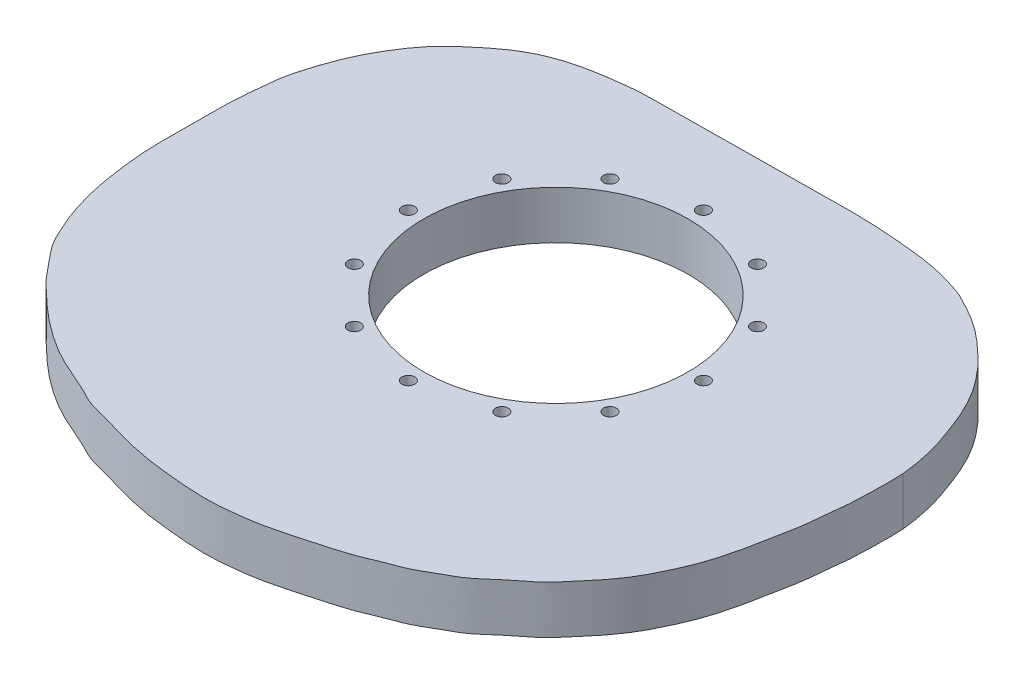
ISO-10303-21;
HEADER;
FILE_DESCRIPTION(('STEP AP214'),'2;1');
FILE_NAME('part.step','',(''),(''),'','','');
FILE_SCHEMA(('AUTOMOTIVE_DESIGN { 1 0 10303 214 1 1 1 1 }'));
ENDSEC;
DATA;
#1=APPLICATION_CONTEXT('core data for automotive mechanical design processes');
#2=APPLICATION_PROTOCOL_DEFINITION('international standard','automotive_design',2000,#1);
#3=PRODUCT_CONTEXT('',#1,'mechanical');
#4=PRODUCT('Part','Part','',(#3));
#5=PRODUCT_RELATED_PRODUCT_CATEGORY('part','',(#4));
#6=PRODUCT_DEFINITION_FORMATION('','',#4);
#7=PRODUCT_DEFINITION_CONTEXT('part definition',#1,'design');
#8=PRODUCT_DEFINITION('design','',#6,#7);
#9=PRODUCT_DEFINITION_SHAPE('','',#8);
#10=(LENGTH_UNIT() NAMED_UNIT(*) SI_UNIT(.MILLI.,.METRE.));
#11=(NAMED_UNIT(*) PLANE_ANGLE_UNIT() SI_UNIT($,.RADIAN.));
#12=(NAMED_UNIT(*) SI_UNIT($,.STERADIAN.) SOLID_ANGLE_UNIT());
#13=UNCERTAINTY_MEASURE_WITH_UNIT(LENGTH_MEASURE(1.E-05),#10,'distance_accuracy_value','');
#14=(GEOMETRIC_REPRESENTATION_CONTEXT(3) GLOBAL_UNCERTAINTY_ASSIGNED_CONTEXT((#13)) GLOBAL_UNIT_ASSIGNED_CONTEXT((#10,
#11,#12)) REPRESENTATION_CONTEXT('',''));
#15=CARTESIAN_POINT('',(0.,0.,0.));
#16=DIRECTION('',(0.,0.,1.));
#17=DIRECTION('',(1.,0.,0.));
#18=AXIS2_PLACEMENT_3D('',#15,#16,#17);
#19=CARTESIAN_POINT('',(-380.049242401864,20.4,11.3845061236139));
#20=CARTESIAN_POINT('',(-379.780162952301,20.4,14.7307854673375));
#21=CARTESIAN_POINT('',(-379.846191862376,20.4,20.9013137044004));
#22=CARTESIAN_POINT('',(-379.978179165826,20.4,32.5081895156437));
#23=CARTESIAN_POINT('',(-380.478735134233,20.4,42.1285726277063));
#24=CARTESIAN_POINT('',(-381.935896415638,20.4,51.4349297154578));
#25=CARTESIAN_POINT('',(-382.239451767936,20.4,58.9167819072398));
#26=CARTESIAN_POINT('',(-383.498849059042,20.4,66.2150618601163));
#27=CARTESIAN_POINT('',(-385.100288245759,20.4,73.5704882095732));
#28=CARTESIAN_POINT('',(-386.854241829526,20.4,84.1235568244484));
#29=CARTESIAN_POINT('',(-388.923669000459,20.4,93.1236220798791));
#30=CARTESIAN_POINT('',(-392.042287791231,20.4,104.805455108899));
#31=CARTESIAN_POINT('',(-397.621768074888,20.4,117.696417735138));
#32=CARTESIAN_POINT('',(-403.000646081092,20.4,128.490795573473));
#33=CARTESIAN_POINT('',(-410.493980899893,20.4,139.328454670797));
#34=CARTESIAN_POINT('',(-418.752029855762,20.4,148.53916230787));
#35=CARTESIAN_POINT('',(-425.254220573375,20.4,156.659460430327));
#36=CARTESIAN_POINT('',(-434.141792993513,20.4,162.772660135546));
#37=CARTESIAN_POINT('',(-442.200673858222,20.4,170.296384681626));
#38=CARTESIAN_POINT('',(-449.285579072647,20.4,175.925612235357));
#39=CARTESIAN_POINT('',(-457.127275413485,20.4,179.763339121568));
#40=CARTESIAN_POINT('',(-466.622184699591,20.4,185.76578685844));
#41=CARTESIAN_POINT('',(-475.470893594921,20.4,188.514516298542));
#42=CARTESIAN_POINT('',(-485.928212709025,20.4,193.471241405311));
#43=CARTESIAN_POINT('',(-500.806129360535,20.4,197.778091630592));
#44=CARTESIAN_POINT('',(-512.58593978717,20.4,201.034632879465));
#45=CARTESIAN_POINT('',(-527.522968625672,20.4,204.922987531498));
#46=CARTESIAN_POINT('',(-539.56970131468,20.4,206.291002112992));
#47=CARTESIAN_POINT('',(-549.976053816279,20.4,207.4281754248));
#48=CARTESIAN_POINT('',(-564.40483180107,20.4,206.832438516235));
#49=CARTESIAN_POINT('',(-575.418430160224,20.4,205.662168010058));
#50=CARTESIAN_POINT('',(-587.878160610122,20.4,204.273850610462));
#51=CARTESIAN_POINT('',(-603.130207722923,20.4,200.783493104247));
#52=CARTESIAN_POINT('',(-612.113684776168,20.4,197.577423722934));
#53=CARTESIAN_POINT('',(-627.718557893987,20.4,194.173130242001));
#54=CARTESIAN_POINT('',(-634.095803665696,20.4,189.897384062605));
#55=CARTESIAN_POINT('',(-651.593849459066,20.4,182.911582900073));
#56=CARTESIAN_POINT('',(-664.382461732481,20.4,175.574467603105));
#57=CARTESIAN_POINT('',(-678.206935923738,20.4,165.478516530878));
#58=CARTESIAN_POINT('',(-687.223081888725,20.4,156.809984362792));
#59=CARTESIAN_POINT('',(-695.525171461678,20.4,149.350196139007));
#60=CARTESIAN_POINT('',(-702.170293731733,20.4,140.542517459404));
#61=CARTESIAN_POINT('',(-709.617350154339,20.4,132.16055239735));
#62=CARTESIAN_POINT('',(-712.082084167832,20.4,127.12503620513));
#63=CARTESIAN_POINT('',(-713.402971141437,20.4,124.355557991248));
#64=B_SPLINE_CURVE_WITH_KNOTS('',3,(#19,#20,#21,#22,#23,#24,#25,#26,#27,#28,#29,#30,#31,#32,#33,
#34,#35,#36,#37,#38,#39,#40,#41,#42,#43,#44,#45,#46,#47,#48,#49,#50,#51,#52,#53,#54,#55,#56,#57,
#58,#59,#60,#61,#62,#63),.UNSPECIFIED.,.F.,.F.,(4,1,1,1,1,1,1,1,1,1,1,1,1,1,1,1,1,1,1,1,1,1,1,1,
1,1,1,1,1,1,1,1,1,1,1,1,1,1,1,1,1,1,4),(0.,0.011057524887745,0.023106803849047,
0.034286565656152,0.045146462907837,0.054906303386894,0.0644612144718484,0.074300184895033,
0.085873006198691,0.0967627123337795,0.109109722933161,0.122485741039739,0.134903237923388,
0.147801700599383,0.160352453572541,0.17177215607166,0.183437491534666,0.195295584152877,
0.20591990748763,0.216455958918776,0.228313211160655,0.239119491013559,0.251227774329023,
0.265193689356207,0.277840174826075,0.291770934589318,0.304140322960004,0.315687360851266,
0.329134843609005,0.341030624064557,0.353715367786723,0.367624517934225,0.379042033809947,
0.392834845349619,0.403004910596959,0.418108184860972,0.432230009470601,0.44682282099098,
0.459474552421583,0.471251080776367,0.483145943696471,0.49495788707002,0.505448590100979),.UNSPECIFIED.);
#65=DIRECTION('',(0.,-1.,0.));
#66=VECTOR('',#65,1.);
#67=SURFACE_OF_LINEAR_EXTRUSION('',#64,#66);
#68=CARTESIAN_POINT('',(-380.049242401864,-5.,11.3845061236139));
#69=CARTESIAN_POINT('',(-379.780162952301,-5.,14.7307854673375));
#70=CARTESIAN_POINT('',(-379.846191862376,-5.,20.9013137044004));
#71=CARTESIAN_POINT('',(-379.978179165826,-5.,32.5081895156437));
#72=CARTESIAN_POINT('',(-380.478735134233,-5.,42.1285726277063));
#73=CARTESIAN_POINT('',(-381.935896415638,-5.,51.4349297154578));
#74=CARTESIAN_POINT('',(-382.239451767936,-5.,58.9167819072398));
#75=CARTESIAN_POINT('',(-383.498849059042,-5.,66.2150618601163));
#76=CARTESIAN_POINT('',(-385.100288245759,-5.,73.5704882095732));
#77=CARTESIAN_POINT('',(-386.854241829526,-5.,84.1235568244484));
#78=CARTESIAN_POINT('',(-388.923669000459,-5.,93.1236220798791));
#79=CARTESIAN_POINT('',(-392.042287791231,-5.,104.805455108899));
#80=CARTESIAN_POINT('',(-397.621768074888,-5.,117.696417735138));
#81=CARTESIAN_POINT('',(-403.000646081092,-5.,128.490795573473));
#82=CARTESIAN_POINT('',(-410.493980899893,-5.,139.328454670797));
#83=CARTESIAN_POINT('',(-418.752029855762,-5.,148.53916230787));
#84=CARTESIAN_POINT('',(-425.254220573375,-5.,156.659460430327));
#85=CARTESIAN_POINT('',(-434.141792993513,-5.,162.772660135546));
#86=CARTESIAN_POINT('',(-442.200673858222,-5.,170.296384681626));
#87=CARTESIAN_POINT('',(-449.285579072647,-5.,175.925612235357));
#88=CARTESIAN_POINT('',(-457.127275413485,-5.,179.763339121568));
#89=CARTESIAN_POINT('',(-466.622184699591,-5.,185.76578685844));
#90=CARTESIAN_POINT('',(-475.470893594921,-5.,188.514516298542));
#91=CARTESIAN_POINT('',(-485.928212709025,-5.,193.471241405311));
#92=CARTESIAN_POINT('',(-500.806129360535,-5.,197.778091630592));
#93=CARTESIAN_POINT('',(-512.58593978717,-5.,201.034632879465));
#94=CARTESIAN_POINT('',(-527.522968625672,-5.,204.922987531498));
#95=CARTESIAN_POINT('',(-539.56970131468,-5.,206.291002112992));
#96=CARTESIAN_POINT('',(-549.976053816279,-5.,207.4281754248));
#97=CARTESIAN_POINT('',(-564.40483180107,-5.,206.832438516235));
#98=CARTESIAN_POINT('',(-575.418430160224,-5.,205.662168010058));
#99=CARTESIAN_POINT('',(-587.878160610122,-5.,204.273850610462));
#100=CARTESIAN_POINT('',(-603.130207722923,-5.,200.783493104247));
#101=CARTESIAN_POINT('',(-612.113684776168,-5.,197.577423722934));
#102=CARTESIAN_POINT('',(-627.718557893987,-5.,194.173130242001));
#103=CARTESIAN_POINT('',(-634.095803665696,-5.,189.897384062605));
#104=CARTESIAN_POINT('',(-651.593849459066,-5.,182.911582900073));
#105=CARTESIAN_POINT('',(-664.382461732481,-5.,175.574467603105));
#106=CARTESIAN_POINT('',(-678.206935923738,-5.,165.478516530878));
#107=CARTESIAN_POINT('',(-687.223081888725,-5.,156.809984362792));
#108=CARTESIAN_POINT('',(-695.525171461678,-5.,149.350196139007));
#109=CARTESIAN_POINT('',(-702.170293731733,-5.,140.542517459404));
#110=CARTESIAN_POINT('',(-709.617350154339,-5.,132.16055239735));
#111=CARTESIAN_POINT('',(-712.082084167832,-5.,127.12503620513));
#112=CARTESIAN_POINT('',(-713.402971141437,-5.,124.355557991248));
#113=B_SPLINE_CURVE_WITH_KNOTS('',3,(#68,#69,#70,#71,#72,#73,#74,#75,#76,#77,#78,#79,#80,#81,
#82,#83,#84,#85,#86,#87,#88,#89,#90,#91,#92,#93,#94,#95,#96,#97,#98,#99,#100,#101,#102,#103,
#104,#105,#106,#107,#108,#109,#110,#111,#112),.UNSPECIFIED.,.F.,.F.,(4,1,1,1,1,1,1,1,1,1,1,1,1,
1,1,1,1,1,1,1,1,1,1,1,1,1,1,1,1,1,1,1,1,1,1,1,1,1,1,1,1,1,4),(0.,0.011057524887745,
0.023106803849047,0.034286565656152,0.045146462907837,0.054906303386894,0.0644612144718484,
0.074300184895033,0.085873006198691,0.0967627123337795,0.109109722933161,0.122485741039739,
0.134903237923388,0.147801700599383,0.160352453572541,0.17177215607166,0.183437491534666,
0.195295584152877,0.20591990748763,0.216455958918776,0.228313211160655,0.239119491013559,
0.251227774329023,0.265193689356207,0.277840174826075,0.291770934589318,0.304140322960004,
0.315687360851266,0.329134843609005,0.341030624064557,0.353715367786723,0.367624517934225,
0.379042033809947,0.392834845349619,0.403004910596959,0.418108184860972,0.432230009470601,
0.44682282099098,0.459474552421583,0.471251080776367,0.483145943696471,0.49495788707002,
0.505448590100979),.UNSPECIFIED.);
#114=CARTESIAN_POINT('',(-380.049242401864,-5.,11.3845061236139));
#115=VERTEX_POINT('',#114);
#116=CARTESIAN_POINT('',(-713.402971141437,-5.,124.355557991248));
#117=VERTEX_POINT('',#116);
#118=EDGE_CURVE('E69',#115,#117,#113,.T.);
#119=ORIENTED_EDGE('',*,*,#118,.F.);
#120=DIRECTION('',(0.,-1.,0.));
#121=VECTOR('',#120,1.);
#122=CARTESIAN_POINT('',(-380.049242401864,20.4,11.3845061236139));
#123=LINE('',#122,#121);
#124=CARTESIAN_POINT('',(-380.049242401864,20.4,11.3845061236139));
#125=VERTEX_POINT('',#124);
#126=EDGE_CURVE('E12',#125,#115,#123,.T.);
#127=ORIENTED_EDGE('',*,*,#126,.F.);
#128=CARTESIAN_POINT('',(-713.402971141437,20.4,124.355557991248));
#129=VERTEX_POINT('',#128);
#130=EDGE_CURVE('E74',#125,#129,#64,.T.);
#131=ORIENTED_EDGE('',*,*,#130,.T.);
#132=DIRECTION('',(0.,-1.,0.));
#133=VECTOR('',#132,1.);
#134=CARTESIAN_POINT('',(-713.402971141437,20.4,124.355557991248));
#135=LINE('',#134,#133);
#136=EDGE_CURVE('E43',#129,#117,#135,.T.);
#137=ORIENTED_EDGE('',*,*,#136,.T.);
#138=EDGE_LOOP('',(#119,#127,#131,#137));
#139=FACE_BOUND('',#138,.T.);
#140=ADVANCED_FACE('F39',(#139),#67,.T.);
#141=CARTESIAN_POINT('',(-713.402971141437,20.4,124.355557991248));
#142=CARTESIAN_POINT('',(-715.032505399705,20.4,120.93894497497));
#143=CARTESIAN_POINT('',(-719.307424347361,20.4,111.760000030505));
#144=CARTESIAN_POINT('',(-725.016148134605,20.4,91.652991887535));
#145=CARTESIAN_POINT('',(-728.210491830365,20.4,66.1658020612224));
#146=CARTESIAN_POINT('',(-728.183208156327,20.4,51.3784886443944));
#147=CARTESIAN_POINT('',(-728.01663630402,20.4,29.6220053179665));
#148=CARTESIAN_POINT('',(-728.061402676971,20.4,15.9523562047483));
#149=CARTESIAN_POINT('',(-726.432591043446,20.4,2.7477317531935));
#150=CARTESIAN_POINT('',(-725.870843695293,20.4,-5.46969876906918));
#151=CARTESIAN_POINT('',(-722.916833642013,20.4,-16.9364821217873));
#152=CARTESIAN_POINT('',(-717.454447416855,20.4,-32.8608975986239));
#153=CARTESIAN_POINT('',(-709.719423575941,20.4,-47.1790170003629));
#154=CARTESIAN_POINT('',(-700.818947164339,20.4,-59.8463921428996));
#155=CARTESIAN_POINT('',(-689.821764123809,20.4,-69.7892767016252));
#156=CARTESIAN_POINT('',(-677.544901799604,20.4,-79.679626512829));
#157=CARTESIAN_POINT('',(-665.55368629642,20.4,-85.8204330644414));
#158=CARTESIAN_POINT('',(-654.698440304467,20.4,-89.3135814280866));
#159=CARTESIAN_POINT('',(-643.969557150908,20.4,-91.505035168801));
#160=CARTESIAN_POINT('',(-632.616728818553,20.4,-93.1086678886019));
#161=CARTESIAN_POINT('',(-625.289819640032,20.4,-93.7426919495092));
#162=CARTESIAN_POINT('',(-620.863987687855,20.4,-94.0648784864602));
#163=CARTESIAN_POINT('',(-537.935613255589,20.4,-94.809968529902));
#164=CARTESIAN_POINT('',(-505.293765442361,20.4,-95.3604930139211));
#165=CARTESIAN_POINT('',(-483.883064645458,20.4,-93.5312414168362));
#166=CARTESIAN_POINT('',(-468.639960146114,20.4,-91.8901143002058));
#167=CARTESIAN_POINT('',(-459.378159259451,20.4,-89.3832489365909));
#168=CARTESIAN_POINT('',(-448.736085977697,20.4,-86.4745650055509));
#169=CARTESIAN_POINT('',(-441.765278826208,20.4,-82.6629916687302));
#170=CARTESIAN_POINT('',(-428.702675028092,20.4,-75.7200109672443));
#171=CARTESIAN_POINT('',(-416.38233597977,20.4,-64.7214781758247));
#172=CARTESIAN_POINT('',(-407.128882868165,20.4,-55.6519871847597));
#173=CARTESIAN_POINT('',(-398.29548692294,20.4,-43.9246514640519));
#174=CARTESIAN_POINT('',(-391.925650274417,20.4,-31.5757661273162));
#175=CARTESIAN_POINT('',(-388.103085236488,20.4,-21.3921433015355));
#176=CARTESIAN_POINT('',(-384.446209251173,20.4,-11.6637144844807));
#177=CARTESIAN_POINT('',(-381.694235544708,20.4,-0.755231417811822));
#178=CARTESIAN_POINT('',(-380.351727708708,20.4,7.62279063135813));
#179=CARTESIAN_POINT('',(-380.049242401864,20.4,11.3845061236139));
#180=B_SPLINE_CURVE_WITH_KNOTS('',3,(#141,#142,#143,#144,#145,#146,#147,#148,#149,#150,#151,
#152,#153,#154,#155,#156,#157,#158,#159,#160,#161,#162,#163,#164,#165,#166,#167,#168,#169,#170,
#171,#172,#173,#174,#175,#176,#177,#178,#179),.UNSPECIFIED.,.F.,.F.,(4,1,1,1,1,1,1,1,1,1,1,1,1,
1,1,1,1,1,1,1,1,1,1,1,1,1,1,1,1,1,1,1,1,1,1,1,4),(0.505448590100979,0.518390620966505,
0.534950073811097,0.552889158867884,0.566882267481526,0.583252797248444,0.596756178736409,
0.609472823143886,0.619643502656757,0.631728613966489,0.646428157970305,0.66089072906802,
0.67480354584206,0.688528394408729,0.702682112902502,0.715735824368265,0.727661195185593,
0.73951894674173,0.751751993278463,0.760828962957055,0.768286629864552,0.800164488858021,
0.822177689618744,0.838023986753107,0.851782326608868,0.862890244862564,0.874452438481538,
0.884527501278101,0.898120883899216,0.912697608456468,0.925545199984826,0.93914414341808,
0.952448677109738,0.964159562931538,0.975547388223282,0.987569698042618,1.),.UNSPECIFIED.);
#181=DIRECTION('',(0.,-1.,0.));
#182=VECTOR('',#181,1.);
#183=SURFACE_OF_LINEAR_EXTRUSION('',#180,#182);
#184=CARTESIAN_POINT('',(-713.402971141437,-5.,124.355557991248));
#185=CARTESIAN_POINT('',(-715.032505399705,-5.,120.93894497497));
#186=CARTESIAN_POINT('',(-719.307424347361,-5.,111.760000030505));
#187=CARTESIAN_POINT('',(-725.016148134605,-5.,91.652991887535));
#188=CARTESIAN_POINT('',(-728.210491830365,-5.,66.1658020612224));
#189=CARTESIAN_POINT('',(-728.183208156327,-5.,51.3784886443944));
#190=CARTESIAN_POINT('',(-728.01663630402,-5.,29.6220053179665));
#191=CARTESIAN_POINT('',(-728.061402676971,-5.,15.9523562047483));
#192=CARTESIAN_POINT('',(-726.432591043446,-5.,2.7477317531935));
#193=CARTESIAN_POINT('',(-725.870843695293,-5.,-5.46969876906918));
#194=CARTESIAN_POINT('',(-722.916833642013,-5.,-16.9364821217873));
#195=CARTESIAN_POINT('',(-717.454447416855,-5.,-32.8608975986239));
#196=CARTESIAN_POINT('',(-709.719423575941,-5.,-47.1790170003629));
#197=CARTESIAN_POINT('',(-700.818947164339,-5.,-59.8463921428996));
#198=CARTESIAN_POINT('',(-689.821764123809,-5.,-69.7892767016252));
#199=CARTESIAN_POINT('',(-677.544901799604,-5.,-79.679626512829));
#200=CARTESIAN_POINT('',(-665.55368629642,-5.,-85.8204330644414));
#201=CARTESIAN_POINT('',(-654.698440304467,-5.,-89.3135814280866));
#202=CARTESIAN_POINT('',(-643.969557150908,-5.,-91.505035168801));
#203=CARTESIAN_POINT('',(-632.616728818553,-5.,-93.1086678886019));
#204=CARTESIAN_POINT('',(-625.289819640032,-5.,-93.7426919495092));
#205=CARTESIAN_POINT('',(-620.863987687855,-5.,-94.0648784864602));
#206=CARTESIAN_POINT('',(-537.935613255589,-5.,-94.809968529902));
#207=CARTESIAN_POINT('',(-505.293765442361,-5.,-95.3604930139211));
#208=CARTESIAN_POINT('',(-483.883064645458,-5.,-93.5312414168362));
#209=CARTESIAN_POINT('',(-468.639960146114,-5.,-91.8901143002058));
#210=CARTESIAN_POINT('',(-459.378159259451,-5.,-89.3832489365909));
#211=CARTESIAN_POINT('',(-448.736085977697,-5.,-86.4745650055509));
#212=CARTESIAN_POINT('',(-441.765278826208,-5.,-82.6629916687302));
#213=CARTESIAN_POINT('',(-428.702675028092,-5.,-75.7200109672443));
#214=CARTESIAN_POINT('',(-416.38233597977,-5.,-64.7214781758247));
#215=CARTESIAN_POINT('',(-407.128882868165,-5.,-55.6519871847597));
#216=CARTESIAN_POINT('',(-398.29548692294,-5.,-43.9246514640519));
#217=CARTESIAN_POINT('',(-391.925650274417,-5.,-31.5757661273162));
#218=CARTESIAN_POINT('',(-388.103085236488,-5.,-21.3921433015355));
#219=CARTESIAN_POINT('',(-384.446209251173,-5.,-11.6637144844807));
#220=CARTESIAN_POINT('',(-381.694235544708,-5.,-0.755231417811822));
#221=CARTESIAN_POINT('',(-380.351727708708,-5.,7.62279063135813));
#222=CARTESIAN_POINT('',(-380.049242401864,-5.,11.3845061236139));
#223=B_SPLINE_CURVE_WITH_KNOTS('',3,(#184,#185,#186,#187,#188,#189,#190,#191,#192,#193,#194,
#195,#196,#197,#198,#199,#200,#201,#202,#203,#204,#205,#206,#207,#208,#209,#210,#211,#212,#213,
#214,#215,#216,#217,#218,#219,#220,#221,#222),.UNSPECIFIED.,.F.,.F.,(4,1,1,1,1,1,1,1,1,1,1,1,1,
1,1,1,1,1,1,1,1,1,1,1,1,1,1,1,1,1,1,1,1,1,1,1,4),(0.505448590100979,0.518390620966505,
0.534950073811097,0.552889158867884,0.566882267481526,0.583252797248444,0.596756178736409,
0.609472823143886,0.619643502656757,0.631728613966489,0.646428157970305,0.66089072906802,
0.67480354584206,0.688528394408729,0.702682112902502,0.715735824368265,0.727661195185593,
0.73951894674173,0.751751993278463,0.760828962957055,0.768286629864552,0.800164488858021,
0.822177689618744,0.838023986753107,0.851782326608868,0.862890244862564,0.874452438481538,
0.884527501278101,0.898120883899216,0.912697608456468,0.925545199984826,0.93914414341808,
0.952448677109738,0.964159562931538,0.975547388223282,0.987569698042618,1.),.UNSPECIFIED.);
#224=EDGE_CURVE('E66',#117,#115,#223,.T.);
#225=ORIENTED_EDGE('',*,*,#224,.F.);
#226=ORIENTED_EDGE('',*,*,#136,.F.);
#227=EDGE_CURVE('E68',#129,#125,#180,.T.);
#228=ORIENTED_EDGE('',*,*,#227,.T.);
#229=ORIENTED_EDGE('',*,*,#126,.T.);
#230=EDGE_LOOP('',(#225,#226,#228,#229));
#231=FACE_BOUND('',#230,.T.);
#232=ADVANCED_FACE('F64',(#231),#183,.T.);
#233=CARTESIAN_POINT('',(-487.474752045354,20.4,193.640341274853));
#234=DIRECTION('',(0.,-1.,0.));
#235=DIRECTION('',(0.,0.,-1.));
#236=AXIS2_PLACEMENT_3D('',#233,#234,#235);
#237=PLANE('',#236);
#238=CARTESIAN_POINT('',(-592.428480293147,20.4,89.0051057122959));
#239=DIRECTION('',(0.,-1.,0.));
#240=DIRECTION('',(0.,0.,-1.));
#241=AXIS2_PLACEMENT_3D('',#238,#239,#240);
#242=CIRCLE('',#241,3.3782);
#243=CARTESIAN_POINT('',(-592.428480293147,20.4,85.6269057122959));
#244=VERTEX_POINT('',#243);
#245=EDGE_CURVE('E190',#244,#244,#242,.T.);
#246=ORIENTED_EDGE('',*,*,#245,.T.);
#247=EDGE_LOOP('',(#246));
#248=FACE_BOUND('',#247,.T.);
#249=CARTESIAN_POINT('',(-620.988637294558,20.4,60.4449487108846));
#250=DIRECTION('',(0.,-1.,0.));
#251=DIRECTION('',(0.,0.,-1.));
#252=AXIS2_PLACEMENT_3D('',#249,#250,#251);
#253=CIRCLE('',#252,3.3782);
#254=CARTESIAN_POINT('',(-620.988637294558,20.4,57.0667487108846));
#255=VERTEX_POINT('',#254);
#256=EDGE_CURVE('E183',#255,#255,#253,.T.);
#257=ORIENTED_EDGE('',*,*,#256,.T.);
#258=EDGE_LOOP('',(#257));
#259=FACE_BOUND('',#258,.T.);
#260=CARTESIAN_POINT('',(-631.442380293147,20.4,21.4310487108846));
#261=DIRECTION('',(0.,-1.,0.));
#262=DIRECTION('',(0.,0.,-1.));
#263=AXIS2_PLACEMENT_3D('',#260,#261,#262);
#264=CIRCLE('',#263,3.3782);
#265=CARTESIAN_POINT('',(-631.442380293147,20.4,18.0528487108846));
#266=VERTEX_POINT('',#265);
#267=EDGE_CURVE('E177',#266,#266,#264,.T.);
#268=ORIENTED_EDGE('',*,*,#267,.T.);
#269=EDGE_LOOP('',(#268));
#270=FACE_BOUND('',#269,.T.);
#271=CARTESIAN_POINT('',(-620.988637294559,20.4,-17.5828512891156));
#272=DIRECTION('',(0.,-1.,0.));
#273=DIRECTION('',(0.,0.,-1.));
#274=AXIS2_PLACEMENT_3D('',#271,#272,#273);
#275=CIRCLE('',#274,3.3782);
#276=CARTESIAN_POINT('',(-620.988637294559,20.4,-20.9610512891156));
#277=VERTEX_POINT('',#276);
#278=EDGE_CURVE('E167',#277,#277,#275,.T.);
#279=ORIENTED_EDGE('',*,*,#278,.T.);
#280=EDGE_LOOP('',(#279));
#281=FACE_BOUND('',#280,.T.);
#282=CARTESIAN_POINT('',(-592.428480293147,20.4,-46.1430082905271));
#283=DIRECTION('',(0.,-1.,0.));
#284=DIRECTION('',(0.,0.,-1.));
#285=AXIS2_PLACEMENT_3D('',#282,#283,#284);
#286=CIRCLE('',#285,3.3782);
#287=CARTESIAN_POINT('',(-592.428480293147,20.4,-49.5212082905271));
#288=VERTEX_POINT('',#287);
#289=EDGE_CURVE('E160',#288,#288,#286,.T.);
#290=ORIENTED_EDGE('',*,*,#289,.T.);
#291=EDGE_LOOP('',(#290));
#292=FACE_BOUND('',#291,.T.);
#293=CARTESIAN_POINT('',(-553.414580293147,20.4,-56.5967512891157));
#294=DIRECTION('',(0.,-1.,0.));
#295=DIRECTION('',(0.,0.,-1.));
#296=AXIS2_PLACEMENT_3D('',#293,#294,#295);
#297=CIRCLE('',#296,3.3782);
#298=CARTESIAN_POINT('',(-553.414580293147,20.4,-59.9749512891157));
#299=VERTEX_POINT('',#298);
#300=EDGE_CURVE('E154',#299,#299,#297,.T.);
#301=ORIENTED_EDGE('',*,*,#300,.T.);
#302=EDGE_LOOP('',(#301));
#303=FACE_BOUND('',#302,.T.);
#304=CARTESIAN_POINT('',(-514.400680293148,20.4,-46.1430082905276));
#305=DIRECTION('',(0.,-1.,0.));
#306=DIRECTION('',(0.,0.,-1.));
#307=AXIS2_PLACEMENT_3D('',#304,#305,#306);
#308=CIRCLE('',#307,3.3782);
#309=CARTESIAN_POINT('',(-514.400680293148,20.4,-49.5212082905276));
#310=VERTEX_POINT('',#309);
#311=EDGE_CURVE('E144',#310,#310,#308,.T.);
#312=ORIENTED_EDGE('',*,*,#311,.T.);
#313=EDGE_LOOP('',(#312));
#314=FACE_BOUND('',#313,.T.);
#315=CARTESIAN_POINT('',(-485.840523291736,20.4,-17.5828512891165));
#316=DIRECTION('',(0.,-1.,0.));
#317=DIRECTION('',(0.,0.,-1.));
#318=AXIS2_PLACEMENT_3D('',#315,#316,#317);
#319=CIRCLE('',#318,3.3782);
#320=CARTESIAN_POINT('',(-485.840523291736,20.4,-20.9610512891165));
#321=VERTEX_POINT('',#320);
#322=EDGE_CURVE('E137',#321,#321,#319,.T.);
#323=ORIENTED_EDGE('',*,*,#322,.T.);
#324=EDGE_LOOP('',(#323));
#325=FACE_BOUND('',#324,.T.);
#326=CARTESIAN_POINT('',(-475.386780293147,20.4,21.4310487108835));
#327=DIRECTION('',(0.,-1.,0.));
#328=DIRECTION('',(0.,0.,-1.));
#329=AXIS2_PLACEMENT_3D('',#326,#327,#328);
#330=CIRCLE('',#329,3.3782);
#331=CARTESIAN_POINT('',(-475.386780293147,20.4,18.0528487108835));
#332=VERTEX_POINT('',#331);
#333=EDGE_CURVE('E131',#332,#332,#330,.T.);
#334=ORIENTED_EDGE('',*,*,#333,.T.);
#335=EDGE_LOOP('',(#334));
#336=FACE_BOUND('',#335,.T.);
#337=CARTESIAN_POINT('',(-485.840523291735,20.4,60.4449487108837));
#338=DIRECTION('',(0.,-1.,0.));
#339=DIRECTION('',(0.,0.,-1.));
#340=AXIS2_PLACEMENT_3D('',#337,#338,#339);
#341=CIRCLE('',#340,3.3782);
#342=CARTESIAN_POINT('',(-485.840523291735,20.4,57.0667487108837));
#343=VERTEX_POINT('',#342);
#344=EDGE_CURVE('E121',#343,#343,#341,.T.);
#345=ORIENTED_EDGE('',*,*,#344,.T.);
#346=EDGE_LOOP('',(#345));
#347=FACE_BOUND('',#346,.T.);
#348=CARTESIAN_POINT('',(-514.400680293147,20.4,89.0051057122953));
#349=DIRECTION('',(0.,-1.,0.));
#350=DIRECTION('',(0.,0.,-1.));
#351=AXIS2_PLACEMENT_3D('',#348,#349,#350);
#352=CIRCLE('',#351,3.3782);
#353=CARTESIAN_POINT('',(-514.400680293147,20.4,85.6269057122953));
#354=VERTEX_POINT('',#353);
#355=EDGE_CURVE('E114',#354,#354,#352,.T.);
#356=ORIENTED_EDGE('',*,*,#355,.T.);
#357=EDGE_LOOP('',(#356));
#358=FACE_BOUND('',#357,.T.);
#359=CARTESIAN_POINT('',(-553.414580293147,20.4,99.4588487108842));
#360=DIRECTION('',(0.,-1.,0.));
#361=DIRECTION('',(0.,0.,-1.));
#362=AXIS2_PLACEMENT_3D('',#359,#360,#361);
#363=CIRCLE('',#362,3.3782);
#364=CARTESIAN_POINT('',(-553.414580293147,20.4,96.0806487108842));
#365=VERTEX_POINT('',#364);
#366=EDGE_CURVE('E100',#365,#365,#363,.T.);
#367=ORIENTED_EDGE('',*,*,#366,.T.);
#368=EDGE_LOOP('',(#367));
#369=FACE_BOUND('',#368,.T.);
#370=CARTESIAN_POINT('',(-553.414580293147,20.4,21.4310487108843));
#371=DIRECTION('',(0.,-1.,0.));
#372=DIRECTION('',(0.,0.,-1.));
#373=AXIS2_PLACEMENT_3D('',#370,#371,#372);
#374=CIRCLE('',#373,70.0278);
#375=CARTESIAN_POINT('',(-553.414580293147,20.4,-48.5967512891157));
#376=VERTEX_POINT('',#375);
#377=EDGE_CURVE('E71',#376,#376,#374,.T.);
#378=ORIENTED_EDGE('',*,*,#377,.T.);
#379=EDGE_LOOP('',(#378));
#380=FACE_BOUND('',#379,.T.);
#381=ORIENTED_EDGE('',*,*,#130,.F.);
#382=ORIENTED_EDGE('',*,*,#227,.F.);
#383=EDGE_LOOP('',(#381,#382));
#384=FACE_BOUND('',#383,.T.);
#385=ADVANCED_FACE('F201',(#248,#259,#270,#281,#292,#303,#314,#325,#336,#347,#358,#369,#380,
#384),#237,.F.);
#386=CARTESIAN_POINT('',(-487.474752045354,-5.,193.640341274853));
#387=DIRECTION('',(0.,-1.,0.));
#388=DIRECTION('',(0.,0.,-1.));
#389=AXIS2_PLACEMENT_3D('',#386,#387,#388);
#390=PLANE('',#389);
#391=CARTESIAN_POINT('',(-592.428480293147,-5.,89.0051057122959));
#392=DIRECTION('',(0.,-1.,0.));
#393=DIRECTION('',(0.,0.,-1.));
#394=AXIS2_PLACEMENT_3D('',#391,#392,#393);
#395=CIRCLE('',#394,3.3782);
#396=CARTESIAN_POINT('',(-592.428480293147,-5.,85.6269057122959));
#397=VERTEX_POINT('',#396);
#398=EDGE_CURVE('E193',#397,#397,#395,.T.);
#399=ORIENTED_EDGE('',*,*,#398,.F.);
#400=EDGE_LOOP('',(#399));
#401=FACE_BOUND('',#400,.T.);
#402=CARTESIAN_POINT('',(-620.988637294558,-5.,60.4449487108846));
#403=DIRECTION('',(0.,-1.,0.));
#404=DIRECTION('',(0.,0.,-1.));
#405=AXIS2_PLACEMENT_3D('',#402,#403,#404);
#406=CIRCLE('',#405,3.3782);
#407=CARTESIAN_POINT('',(-620.988637294558,-5.,57.0667487108846));
#408=VERTEX_POINT('',#407);
#409=EDGE_CURVE('E186',#408,#408,#406,.T.);
#410=ORIENTED_EDGE('',*,*,#409,.F.);
#411=EDGE_LOOP('',(#410));
#412=FACE_BOUND('',#411,.T.);
#413=CARTESIAN_POINT('',(-631.442380293147,-5.,21.4310487108846));
#414=DIRECTION('',(0.,-1.,0.));
#415=DIRECTION('',(0.,0.,-1.));
#416=AXIS2_PLACEMENT_3D('',#413,#414,#415);
#417=CIRCLE('',#416,3.3782);
#418=CARTESIAN_POINT('',(-631.442380293147,-5.,18.0528487108846));
#419=VERTEX_POINT('',#418);
#420=EDGE_CURVE('E179',#419,#419,#417,.T.);
#421=ORIENTED_EDGE('',*,*,#420,.F.);
#422=EDGE_LOOP('',(#421));
#423=FACE_BOUND('',#422,.T.);
#424=CARTESIAN_POINT('',(-620.988637294559,-5.,-17.5828512891156));
#425=DIRECTION('',(0.,-1.,0.));
#426=DIRECTION('',(0.,0.,-1.));
#427=AXIS2_PLACEMENT_3D('',#424,#425,#426);
#428=CIRCLE('',#427,3.3782);
#429=CARTESIAN_POINT('',(-620.988637294559,-5.,-20.9610512891156));
#430=VERTEX_POINT('',#429);
#431=EDGE_CURVE('E173',#430,#430,#428,.T.);
#432=ORIENTED_EDGE('',*,*,#431,.F.);
#433=EDGE_LOOP('',(#432));
#434=FACE_BOUND('',#433,.T.);
#435=CARTESIAN_POINT('',(-592.428480293147,-5.,-46.1430082905271));
#436=DIRECTION('',(0.,-1.,0.));
#437=DIRECTION('',(0.,0.,-1.));
#438=AXIS2_PLACEMENT_3D('',#435,#436,#437);
#439=CIRCLE('',#438,3.3782);
#440=CARTESIAN_POINT('',(-592.428480293147,-5.,-49.5212082905271));
#441=VERTEX_POINT('',#440);
#442=EDGE_CURVE('E163',#441,#441,#439,.T.);
#443=ORIENTED_EDGE('',*,*,#442,.F.);
#444=EDGE_LOOP('',(#443));
#445=FACE_BOUND('',#444,.T.);
#446=CARTESIAN_POINT('',(-553.414580293147,-5.,-56.5967512891157));
#447=DIRECTION('',(0.,-1.,0.));
#448=DIRECTION('',(0.,0.,-1.));
#449=AXIS2_PLACEMENT_3D('',#446,#447,#448);
#450=CIRCLE('',#449,3.3782);
#451=CARTESIAN_POINT('',(-553.414580293147,-5.,-59.9749512891157));
#452=VERTEX_POINT('',#451);
#453=EDGE_CURVE('E156',#452,#452,#450,.T.);
#454=ORIENTED_EDGE('',*,*,#453,.F.);
#455=EDGE_LOOP('',(#454));
#456=FACE_BOUND('',#455,.T.);
#457=CARTESIAN_POINT('',(-514.400680293148,-5.,-46.1430082905276));
#458=DIRECTION('',(0.,-1.,0.));
#459=DIRECTION('',(0.,0.,-1.));
#460=AXIS2_PLACEMENT_3D('',#457,#458,#459);
#461=CIRCLE('',#460,3.3782);
#462=CARTESIAN_POINT('',(-514.400680293148,-5.,-49.5212082905276));
#463=VERTEX_POINT('',#462);
#464=EDGE_CURVE('E150',#463,#463,#461,.T.);
#465=ORIENTED_EDGE('',*,*,#464,.F.);
#466=EDGE_LOOP('',(#465));
#467=FACE_BOUND('',#466,.T.);
#468=CARTESIAN_POINT('',(-485.840523291736,-5.,-17.5828512891165));
#469=DIRECTION('',(0.,-1.,0.));
#470=DIRECTION('',(0.,0.,-1.));
#471=AXIS2_PLACEMENT_3D('',#468,#469,#470);
#472=CIRCLE('',#471,3.3782);
#473=CARTESIAN_POINT('',(-485.840523291736,-5.,-20.9610512891165));
#474=VERTEX_POINT('',#473);
#475=EDGE_CURVE('E140',#474,#474,#472,.T.);
#476=ORIENTED_EDGE('',*,*,#475,.F.);
#477=EDGE_LOOP('',(#476));
#478=FACE_BOUND('',#477,.T.);
#479=CARTESIAN_POINT('',(-475.386780293147,-5.,21.4310487108835));
#480=DIRECTION('',(0.,-1.,0.));
#481=DIRECTION('',(0.,0.,-1.));
#482=AXIS2_PLACEMENT_3D('',#479,#480,#481);
#483=CIRCLE('',#482,3.3782);
#484=CARTESIAN_POINT('',(-475.386780293147,-5.,18.0528487108835));
#485=VERTEX_POINT('',#484);
#486=EDGE_CURVE('E133',#485,#485,#483,.T.);
#487=ORIENTED_EDGE('',*,*,#486,.F.);
#488=EDGE_LOOP('',(#487));
#489=FACE_BOUND('',#488,.T.);
#490=CARTESIAN_POINT('',(-485.840523291735,-5.,60.4449487108837));
#491=DIRECTION('',(0.,-1.,0.));
#492=DIRECTION('',(0.,0.,-1.));
#493=AXIS2_PLACEMENT_3D('',#490,#491,#492);
#494=CIRCLE('',#493,3.3782);
#495=CARTESIAN_POINT('',(-485.840523291735,-5.,57.0667487108837));
#496=VERTEX_POINT('',#495);
#497=EDGE_CURVE('E127',#496,#496,#494,.T.);
#498=ORIENTED_EDGE('',*,*,#497,.F.);
#499=EDGE_LOOP('',(#498));
#500=FACE_BOUND('',#499,.T.);
#501=CARTESIAN_POINT('',(-514.400680293147,-5.,89.0051057122953));
#502=DIRECTION('',(0.,-1.,0.));
#503=DIRECTION('',(0.,0.,-1.));
#504=AXIS2_PLACEMENT_3D('',#501,#502,#503);
#505=CIRCLE('',#504,3.3782);
#506=CARTESIAN_POINT('',(-514.400680293147,-5.,85.6269057122953));
#507=VERTEX_POINT('',#506);
#508=EDGE_CURVE('E117',#507,#507,#505,.T.);
#509=ORIENTED_EDGE('',*,*,#508,.F.);
#510=EDGE_LOOP('',(#509));
#511=FACE_BOUND('',#510,.T.);
#512=CARTESIAN_POINT('',(-553.414580293147,-5.,99.4588487108842));
#513=DIRECTION('',(0.,-1.,0.));
#514=DIRECTION('',(0.,0.,-1.));
#515=AXIS2_PLACEMENT_3D('',#512,#513,#514);
#516=CIRCLE('',#515,3.3782);
#517=CARTESIAN_POINT('',(-553.414580293147,-5.,96.0806487108842));
#518=VERTEX_POINT('',#517);
#519=EDGE_CURVE('E110',#518,#518,#516,.T.);
#520=ORIENTED_EDGE('',*,*,#519,.F.);
#521=EDGE_LOOP('',(#520));
#522=FACE_BOUND('',#521,.T.);
#523=CARTESIAN_POINT('',(-553.414580293147,-5.,21.4310487108843));
#524=DIRECTION('',(0.,-1.,0.));
#525=DIRECTION('',(0.,0.,-1.));
#526=AXIS2_PLACEMENT_3D('',#523,#524,#525);
#527=CIRCLE('',#526,70.0278);
#528=CARTESIAN_POINT('',(-553.414580293147,-5.,-48.5967512891157));
#529=VERTEX_POINT('',#528);
#530=EDGE_CURVE('E96',#529,#529,#527,.T.);
#531=ORIENTED_EDGE('',*,*,#530,.F.);
#532=EDGE_LOOP('',(#531));
#533=FACE_BOUND('',#532,.T.);
#534=ORIENTED_EDGE('',*,*,#118,.T.);
#535=ORIENTED_EDGE('',*,*,#224,.T.);
#536=EDGE_LOOP('',(#534,#535));
#537=FACE_BOUND('',#536,.T.);
#538=ADVANCED_FACE('F73',(#401,#412,#423,#434,#445,#456,#467,#478,#489,#500,#511,#522,#533,
#537),#390,.T.);
#539=CARTESIAN_POINT('',(-553.414580293147,20.4,21.4310487108843));
#540=DIRECTION('',(0.,-1.,0.));
#541=DIRECTION('',(0.,0.,-1.));
#542=AXIS2_PLACEMENT_3D('',#539,#540,#541);
#543=CYLINDRICAL_SURFACE('',#542,70.0278);
#544=ORIENTED_EDGE('',*,*,#377,.F.);
#545=EDGE_LOOP('',(#544));
#546=FACE_BOUND('',#545,.T.);
#547=ORIENTED_EDGE('',*,*,#530,.T.);
#548=EDGE_LOOP('',(#547));
#549=FACE_BOUND('',#548,.T.);
#550=ADVANCED_FACE('F224',(#546,#549),#543,.F.);
#551=CARTESIAN_POINT('',(-553.414580293147,-5.,99.4588487108842));
#552=DIRECTION('',(0.,-1.,0.));
#553=DIRECTION('',(0.,0.,-1.));
#554=AXIS2_PLACEMENT_3D('',#551,#552,#553);
#555=CYLINDRICAL_SURFACE('',#554,3.3782);
#556=ORIENTED_EDGE('',*,*,#366,.F.);
#557=EDGE_LOOP('',(#556));
#558=FACE_BOUND('',#557,.T.);
#559=ORIENTED_EDGE('',*,*,#519,.T.);
#560=EDGE_LOOP('',(#559));
#561=FACE_BOUND('',#560,.T.);
#562=ADVANCED_FACE('F229',(#558,#561),#555,.F.);
#563=CARTESIAN_POINT('',(-514.400680293147,-5.,89.0051057122953));
#564=DIRECTION('',(0.,-1.,0.));
#565=DIRECTION('',(0.,0.,-1.));
#566=AXIS2_PLACEMENT_3D('',#563,#564,#565);
#567=CYLINDRICAL_SURFACE('',#566,3.3782);
#568=ORIENTED_EDGE('',*,*,#355,.F.);
#569=EDGE_LOOP('',(#568));
#570=FACE_BOUND('',#569,.T.);
#571=ORIENTED_EDGE('',*,*,#508,.T.);
#572=EDGE_LOOP('',(#571));
#573=FACE_BOUND('',#572,.T.);
#574=ADVANCED_FACE('F233',(#570,#573),#567,.F.);
#575=CARTESIAN_POINT('',(-485.840523291735,-5.,60.4449487108837));
#576=DIRECTION('',(0.,-1.,0.));
#577=DIRECTION('',(0.,0.,-1.));
#578=AXIS2_PLACEMENT_3D('',#575,#576,#577);
#579=CYLINDRICAL_SURFACE('',#578,3.3782);
#580=ORIENTED_EDGE('',*,*,#344,.F.);
#581=EDGE_LOOP('',(#580));
#582=FACE_BOUND('',#581,.T.);
#583=ORIENTED_EDGE('',*,*,#497,.T.);
#584=EDGE_LOOP('',(#583));
#585=FACE_BOUND('',#584,.T.);
#586=ADVANCED_FACE('F237',(#582,#585),#579,.F.);
#587=CARTESIAN_POINT('',(-475.386780293147,-5.,21.4310487108835));
#588=DIRECTION('',(0.,-1.,0.));
#589=DIRECTION('',(0.,0.,-1.));
#590=AXIS2_PLACEMENT_3D('',#587,#588,#589);
#591=CYLINDRICAL_SURFACE('',#590,3.3782);
#592=ORIENTED_EDGE('',*,*,#333,.F.);
#593=EDGE_LOOP('',(#592));
#594=FACE_BOUND('',#593,.T.);
#595=ORIENTED_EDGE('',*,*,#486,.T.);
#596=EDGE_LOOP('',(#595));
#597=FACE_BOUND('',#596,.T.);
#598=ADVANCED_FACE('F241',(#594,#597),#591,.F.);
#599=CARTESIAN_POINT('',(-485.840523291736,-5.,-17.5828512891165));
#600=DIRECTION('',(0.,-1.,0.));
#601=DIRECTION('',(0.,0.,-1.));
#602=AXIS2_PLACEMENT_3D('',#599,#600,#601);
#603=CYLINDRICAL_SURFACE('',#602,3.3782);
#604=ORIENTED_EDGE('',*,*,#322,.F.);
#605=EDGE_LOOP('',(#604));
#606=FACE_BOUND('',#605,.T.);
#607=ORIENTED_EDGE('',*,*,#475,.T.);
#608=EDGE_LOOP('',(#607));
#609=FACE_BOUND('',#608,.T.);
#610=ADVANCED_FACE('F245',(#606,#609),#603,.F.);
#611=CARTESIAN_POINT('',(-514.400680293148,-5.,-46.1430082905276));
#612=DIRECTION('',(0.,-1.,0.));
#613=DIRECTION('',(0.,0.,-1.));
#614=AXIS2_PLACEMENT_3D('',#611,#612,#613);
#615=CYLINDRICAL_SURFACE('',#614,3.3782);
#616=ORIENTED_EDGE('',*,*,#311,.F.);
#617=EDGE_LOOP('',(#616));
#618=FACE_BOUND('',#617,.T.);
#619=ORIENTED_EDGE('',*,*,#464,.T.);
#620=EDGE_LOOP('',(#619));
#621=FACE_BOUND('',#620,.T.);
#622=ADVANCED_FACE('F249',(#618,#621),#615,.F.);
#623=CARTESIAN_POINT('',(-553.414580293147,-5.,-56.5967512891157));
#624=DIRECTION('',(0.,-1.,0.));
#625=DIRECTION('',(0.,0.,-1.));
#626=AXIS2_PLACEMENT_3D('',#623,#624,#625);
#627=CYLINDRICAL_SURFACE('',#626,3.3782);
#628=ORIENTED_EDGE('',*,*,#300,.F.);
#629=EDGE_LOOP('',(#628));
#630=FACE_BOUND('',#629,.T.);
#631=ORIENTED_EDGE('',*,*,#453,.T.);
#632=EDGE_LOOP('',(#631));
#633=FACE_BOUND('',#632,.T.);
#634=ADVANCED_FACE('F253',(#630,#633),#627,.F.);
#635=CARTESIAN_POINT('',(-592.428480293147,-5.,-46.1430082905271));
#636=DIRECTION('',(0.,-1.,0.));
#637=DIRECTION('',(0.,0.,-1.));
#638=AXIS2_PLACEMENT_3D('',#635,#636,#637);
#639=CYLINDRICAL_SURFACE('',#638,3.3782);
#640=ORIENTED_EDGE('',*,*,#289,.F.);
#641=EDGE_LOOP('',(#640));
#642=FACE_BOUND('',#641,.T.);
#643=ORIENTED_EDGE('',*,*,#442,.T.);
#644=EDGE_LOOP('',(#643));
#645=FACE_BOUND('',#644,.T.);
#646=ADVANCED_FACE('F257',(#642,#645),#639,.F.);
#647=CARTESIAN_POINT('',(-620.988637294559,-5.,-17.5828512891156));
#648=DIRECTION('',(0.,-1.,0.));
#649=DIRECTION('',(0.,0.,-1.));
#650=AXIS2_PLACEMENT_3D('',#647,#648,#649);
#651=CYLINDRICAL_SURFACE('',#650,3.3782);
#652=ORIENTED_EDGE('',*,*,#278,.F.);
#653=EDGE_LOOP('',(#652));
#654=FACE_BOUND('',#653,.T.);
#655=ORIENTED_EDGE('',*,*,#431,.T.);
#656=EDGE_LOOP('',(#655));
#657=FACE_BOUND('',#656,.T.);
#658=ADVANCED_FACE('F261',(#654,#657),#651,.F.);
#659=CARTESIAN_POINT('',(-631.442380293147,-5.,21.4310487108846));
#660=DIRECTION('',(0.,-1.,0.));
#661=DIRECTION('',(0.,0.,-1.));
#662=AXIS2_PLACEMENT_3D('',#659,#660,#661);
#663=CYLINDRICAL_SURFACE('',#662,3.3782);
#664=ORIENTED_EDGE('',*,*,#267,.F.);
#665=EDGE_LOOP('',(#664));
#666=FACE_BOUND('',#665,.T.);
#667=ORIENTED_EDGE('',*,*,#420,.T.);
#668=EDGE_LOOP('',(#667));
#669=FACE_BOUND('',#668,.T.);
#670=ADVANCED_FACE('F211',(#666,#669),#663,.F.);
#671=CARTESIAN_POINT('',(-620.988637294558,-5.,60.4449487108846));
#672=DIRECTION('',(0.,-1.,0.));
#673=DIRECTION('',(0.,0.,-1.));
#674=AXIS2_PLACEMENT_3D('',#671,#672,#673);
#675=CYLINDRICAL_SURFACE('',#674,3.3782);
#676=ORIENTED_EDGE('',*,*,#256,.F.);
#677=EDGE_LOOP('',(#676));
#678=FACE_BOUND('',#677,.T.);
#679=ORIENTED_EDGE('',*,*,#409,.T.);
#680=EDGE_LOOP('',(#679));
#681=FACE_BOUND('',#680,.T.);
#682=ADVANCED_FACE('F206',(#678,#681),#675,.F.);
#683=CARTESIAN_POINT('',(-592.428480293147,-5.,89.0051057122959));
#684=DIRECTION('',(0.,-1.,0.));
#685=DIRECTION('',(0.,0.,-1.));
#686=AXIS2_PLACEMENT_3D('',#683,#684,#685);
#687=CYLINDRICAL_SURFACE('',#686,3.3782);
#688=ORIENTED_EDGE('',*,*,#245,.F.);
#689=EDGE_LOOP('',(#688));
#690=FACE_BOUND('',#689,.T.);
#691=ORIENTED_EDGE('',*,*,#398,.T.);
#692=EDGE_LOOP('',(#691));
#693=FACE_BOUND('',#692,.T.);
#694=ADVANCED_FACE('F204',(#690,#693),#687,.F.);
#695=CLOSED_SHELL('',(#140,#232,#385,#538,#550,#562,#574,#586,#598,#610,#622,#634,#646,#658,
#670,#682,#694));
#696=MANIFOLD_SOLID_BREP('B2',#695);
#697=ADVANCED_BREP_SHAPE_REPRESENTATION('',(#18,#696),#14);
#698=SHAPE_DEFINITION_REPRESENTATION(#9,#697);
ENDSEC;
END-ISO-10303-21;
